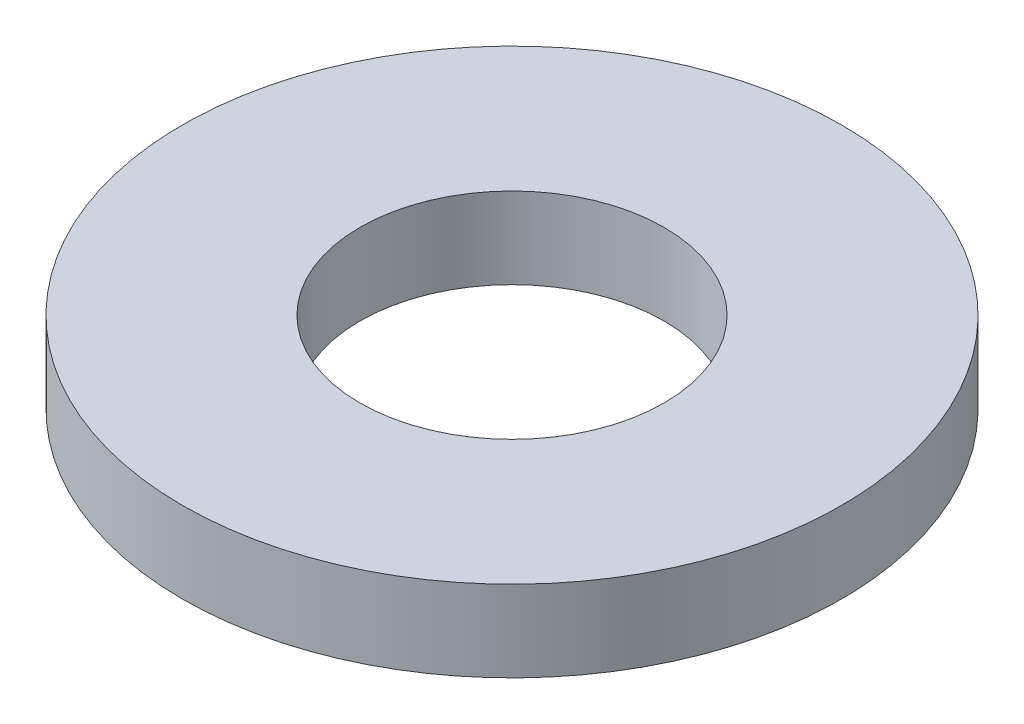
ISO-10303-21;
HEADER;
FILE_DESCRIPTION(('STEP AP214'),'2;1');
FILE_NAME('part.step','',(''),(''),'','','');
FILE_SCHEMA(('AUTOMOTIVE_DESIGN { 1 0 10303 214 1 1 1 1 }'));
ENDSEC;
DATA;
#1=APPLICATION_CONTEXT('core data for automotive mechanical design processes');
#2=APPLICATION_PROTOCOL_DEFINITION('international standard','automotive_design',2000,#1);
#3=PRODUCT_CONTEXT('',#1,'mechanical');
#4=PRODUCT('Part','Part','',(#3));
#5=PRODUCT_RELATED_PRODUCT_CATEGORY('part','',(#4));
#6=PRODUCT_DEFINITION_FORMATION('','',#4);
#7=PRODUCT_DEFINITION_CONTEXT('part definition',#1,'design');
#8=PRODUCT_DEFINITION('design','',#6,#7);
#9=PRODUCT_DEFINITION_SHAPE('','',#8);
#10=(LENGTH_UNIT() NAMED_UNIT(*) SI_UNIT(.MILLI.,.METRE.));
#11=(NAMED_UNIT(*) PLANE_ANGLE_UNIT() SI_UNIT($,.RADIAN.));
#12=(NAMED_UNIT(*) SI_UNIT($,.STERADIAN.) SOLID_ANGLE_UNIT());
#13=UNCERTAINTY_MEASURE_WITH_UNIT(LENGTH_MEASURE(1.E-05),#10,'distance_accuracy_value','');
#14=(GEOMETRIC_REPRESENTATION_CONTEXT(3) GLOBAL_UNCERTAINTY_ASSIGNED_CONTEXT((#13)) GLOBAL_UNIT_ASSIGNED_CONTEXT((#10,
#11,#12)) REPRESENTATION_CONTEXT('',''));
#15=CARTESIAN_POINT('',(0.,0.,0.));
#16=DIRECTION('',(0.,0.,1.));
#17=DIRECTION('',(1.,0.,0.));
#18=AXIS2_PLACEMENT_3D('',#15,#16,#17);
#19=CARTESIAN_POINT('',(0.,16.,0.));
#20=DIRECTION('',(0.,-1.,0.));
#21=DIRECTION('',(0.,0.,-1.));
#22=AXIS2_PLACEMENT_3D('',#19,#20,#21);
#23=CYLINDRICAL_SURFACE('',#22,65.);
#24=CARTESIAN_POINT('',(0.,16.,0.));
#25=DIRECTION('',(0.,1.,0.));
#26=DIRECTION('',(0.,0.,1.));
#27=AXIS2_PLACEMENT_3D('',#24,#25,#26);
#28=CIRCLE('',#27,65.);
#29=CARTESIAN_POINT('',(0.,16.,65.));
#30=VERTEX_POINT('',#29);
#31=EDGE_CURVE('E10',#30,#30,#28,.T.);
#32=ORIENTED_EDGE('',*,*,#31,.F.);
#33=EDGE_LOOP('',(#32));
#34=FACE_BOUND('',#33,.T.);
#35=CARTESIAN_POINT('',(0.,0.,0.));
#36=DIRECTION('',(0.,1.,0.));
#37=DIRECTION('',(0.,0.,1.));
#38=AXIS2_PLACEMENT_3D('',#35,#36,#37);
#39=CIRCLE('',#38,65.);
#40=CARTESIAN_POINT('',(0.,0.,65.));
#41=VERTEX_POINT('',#40);
#42=EDGE_CURVE('E37',#41,#41,#39,.T.);
#43=ORIENTED_EDGE('',*,*,#42,.T.);
#44=EDGE_LOOP('',(#43));
#45=FACE_BOUND('',#44,.T.);
#46=ADVANCED_FACE('F40',(#34,#45),#23,.T.);
#47=CARTESIAN_POINT('',(0.,16.,0.));
#48=DIRECTION('',(0.,1.,0.));
#49=DIRECTION('',(0.,0.,1.));
#50=AXIS2_PLACEMENT_3D('',#47,#48,#49);
#51=PLANE('',#50);
#52=CARTESIAN_POINT('',(0.,16.,0.));
#53=DIRECTION('',(0.,1.,0.));
#54=DIRECTION('',(0.,0.,1.));
#55=AXIS2_PLACEMENT_3D('',#52,#53,#54);
#56=CIRCLE('',#55,30.);
#57=CARTESIAN_POINT('',(0.,16.,30.));
#58=VERTEX_POINT('',#57);
#59=EDGE_CURVE('E50',#58,#58,#56,.T.);
#60=ORIENTED_EDGE('',*,*,#59,.F.);
#61=EDGE_LOOP('',(#60));
#62=FACE_BOUND('',#61,.T.);
#63=ORIENTED_EDGE('',*,*,#31,.T.);
#64=EDGE_LOOP('',(#63));
#65=FACE_BOUND('',#64,.T.);
#66=ADVANCED_FACE('F59',(#62,#65),#51,.T.);
#67=CARTESIAN_POINT('',(0.,0.,0.));
#68=DIRECTION('',(0.,1.,0.));
#69=DIRECTION('',(0.,0.,1.));
#70=AXIS2_PLACEMENT_3D('',#67,#68,#69);
#71=PLANE('',#70);
#72=CARTESIAN_POINT('',(0.,0.,0.));
#73=DIRECTION('',(0.,1.,0.));
#74=DIRECTION('',(0.,0.,1.));
#75=AXIS2_PLACEMENT_3D('',#72,#73,#74);
#76=CIRCLE('',#75,30.);
#77=CARTESIAN_POINT('',(0.,0.,30.));
#78=VERTEX_POINT('',#77);
#79=EDGE_CURVE('E47',#78,#78,#76,.T.);
#80=ORIENTED_EDGE('',*,*,#79,.T.);
#81=EDGE_LOOP('',(#80));
#82=FACE_BOUND('',#81,.T.);
#83=ORIENTED_EDGE('',*,*,#42,.F.);
#84=EDGE_LOOP('',(#83));
#85=FACE_BOUND('',#84,.T.);
#86=ADVANCED_FACE('F58',(#82,#85),#71,.F.);
#87=CARTESIAN_POINT('',(0.,16.,0.));
#88=DIRECTION('',(0.,-1.,0.));
#89=DIRECTION('',(0.,0.,-1.));
#90=AXIS2_PLACEMENT_3D('',#87,#88,#89);
#91=CYLINDRICAL_SURFACE('',#90,30.);
#92=ORIENTED_EDGE('',*,*,#59,.T.);
#93=EDGE_LOOP('',(#92));
#94=FACE_BOUND('',#93,.T.);
#95=ORIENTED_EDGE('',*,*,#79,.F.);
#96=EDGE_LOOP('',(#95));
#97=FACE_BOUND('',#96,.T.);
#98=ADVANCED_FACE('F54',(#94,#97),#91,.F.);
#99=CLOSED_SHELL('',(#46,#66,#86,#98));
#100=MANIFOLD_SOLID_BREP('B2',#99);
#101=ADVANCED_BREP_SHAPE_REPRESENTATION('',(#18,#100),#14);
#102=SHAPE_DEFINITION_REPRESENTATION(#9,#101);
ENDSEC;
END-ISO-10303-21;
